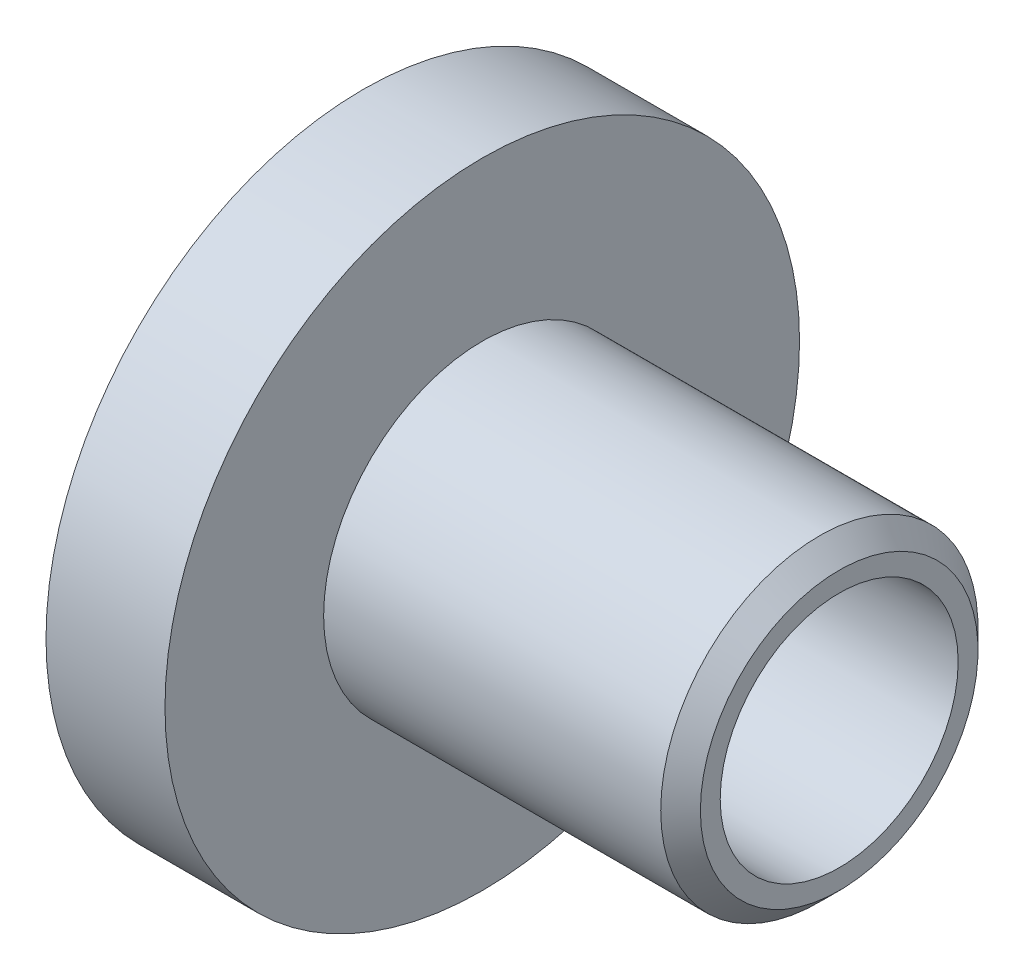
ISO-10303-21;
HEADER;
FILE_DESCRIPTION(('STEP AP214'),'2;1');
FILE_NAME('part.step','',(''),(''),'','','');
FILE_SCHEMA(('AUTOMOTIVE_DESIGN { 1 0 10303 214 1 1 1 1 }'));
ENDSEC;
DATA;
#1=APPLICATION_CONTEXT('core data for automotive mechanical design processes');
#2=APPLICATION_PROTOCOL_DEFINITION('international standard','automotive_design',2000,#1);
#3=PRODUCT_CONTEXT('',#1,'mechanical');
#4=PRODUCT('Part','Part','',(#3));
#5=PRODUCT_RELATED_PRODUCT_CATEGORY('part','',(#4));
#6=PRODUCT_DEFINITION_FORMATION('','',#4);
#7=PRODUCT_DEFINITION_CONTEXT('part definition',#1,'design');
#8=PRODUCT_DEFINITION('design','',#6,#7);
#9=PRODUCT_DEFINITION_SHAPE('','',#8);
#10=(LENGTH_UNIT() NAMED_UNIT(*) SI_UNIT(.MILLI.,.METRE.));
#11=(NAMED_UNIT(*) PLANE_ANGLE_UNIT() SI_UNIT($,.RADIAN.));
#12=(NAMED_UNIT(*) SI_UNIT($,.STERADIAN.) SOLID_ANGLE_UNIT());
#13=UNCERTAINTY_MEASURE_WITH_UNIT(LENGTH_MEASURE(1.E-05),#10,'distance_accuracy_value','');
#14=(GEOMETRIC_REPRESENTATION_CONTEXT(3) GLOBAL_UNCERTAINTY_ASSIGNED_CONTEXT((#13)) GLOBAL_UNIT_ASSIGNED_CONTEXT((#10,
#11,#12)) REPRESENTATION_CONTEXT('',''));
#15=CARTESIAN_POINT('',(0.,0.,0.));
#16=DIRECTION('',(0.,0.,1.));
#17=DIRECTION('',(1.,0.,0.));
#18=AXIS2_PLACEMENT_3D('',#15,#16,#17);
#19=CARTESIAN_POINT('',(0.,0.,0.));
#20=DIRECTION('',(-1.,0.,0.));
#21=DIRECTION('',(0.,0.,1.));
#22=AXIS2_PLACEMENT_3D('',#19,#20,#21);
#23=CYLINDRICAL_SURFACE('',#22,6.);
#24=CARTESIAN_POINT('',(24.,0.,0.));
#25=DIRECTION('',(-1.,0.,0.));
#26=DIRECTION('',(0.,0.,1.));
#27=AXIS2_PLACEMENT_3D('',#24,#25,#26);
#28=CIRCLE('',#27,6.);
#29=CARTESIAN_POINT('',(24.,0.,6.));
#30=VERTEX_POINT('',#29);
#31=EDGE_CURVE('E26',#30,#30,#28,.T.);
#32=ORIENTED_EDGE('',*,*,#31,.F.);
#33=EDGE_LOOP('',(#32));
#34=FACE_BOUND('',#33,.T.);
#35=CARTESIAN_POINT('',(0.,0.,0.));
#36=DIRECTION('',(-1.,0.,0.));
#37=DIRECTION('',(0.,0.,1.));
#38=AXIS2_PLACEMENT_3D('',#35,#36,#37);
#39=CIRCLE('',#38,6.);
#40=CARTESIAN_POINT('',(0.,0.,6.));
#41=VERTEX_POINT('',#40);
#42=EDGE_CURVE('E41',#41,#41,#39,.T.);
#43=ORIENTED_EDGE('',*,*,#42,.T.);
#44=EDGE_LOOP('',(#43));
#45=FACE_BOUND('',#44,.T.);
#46=ADVANCED_FACE('F15',(#34,#45),#23,.F.);
#47=CARTESIAN_POINT('',(24.,8.,0.));
#48=DIRECTION('',(-1.,0.,0.));
#49=DIRECTION('',(0.,0.,1.));
#50=AXIS2_PLACEMENT_3D('',#47,#48,#49);
#51=PLANE('',#50);
#52=CARTESIAN_POINT('',(24.,0.,0.));
#53=DIRECTION('',(-1.,0.,0.));
#54=DIRECTION('',(0.,0.,1.));
#55=AXIS2_PLACEMENT_3D('',#52,#53,#54);
#56=CIRCLE('',#55,7.);
#57=CARTESIAN_POINT('',(24.,0.,7.));
#58=VERTEX_POINT('',#57);
#59=EDGE_CURVE('E10',#58,#58,#56,.F.);
#60=ORIENTED_EDGE('',*,*,#59,.T.);
#61=EDGE_LOOP('',(#60));
#62=FACE_BOUND('',#61,.T.);
#63=ORIENTED_EDGE('',*,*,#31,.T.);
#64=EDGE_LOOP('',(#63));
#65=FACE_BOUND('',#64,.T.);
#66=ADVANCED_FACE('F66',(#62,#65),#51,.F.);
#67=CARTESIAN_POINT('',(0.,0.,0.));
#68=DIRECTION('',(-1.,0.,0.));
#69=DIRECTION('',(0.,0.,1.));
#70=AXIS2_PLACEMENT_3D('',#67,#68,#69);
#71=CYLINDRICAL_SURFACE('',#70,8.);
#72=CARTESIAN_POINT('',(23.,0.,0.));
#73=DIRECTION('',(-1.,0.,0.));
#74=DIRECTION('',(0.,0.,1.));
#75=AXIS2_PLACEMENT_3D('',#72,#73,#74);
#76=CIRCLE('',#75,8.);
#77=CARTESIAN_POINT('',(23.,0.,8.));
#78=VERTEX_POINT('',#77);
#79=EDGE_CURVE('E22',#78,#78,#76,.T.);
#80=ORIENTED_EDGE('',*,*,#79,.T.);
#81=EDGE_LOOP('',(#80));
#82=FACE_BOUND('',#81,.T.);
#83=CARTESIAN_POINT('',(6.,0.,0.));
#84=DIRECTION('',(-1.,0.,0.));
#85=DIRECTION('',(0.,0.,1.));
#86=AXIS2_PLACEMENT_3D('',#83,#84,#85);
#87=CIRCLE('',#86,8.);
#88=CARTESIAN_POINT('',(6.,0.,8.));
#89=VERTEX_POINT('',#88);
#90=EDGE_CURVE('E30',#89,#89,#87,.T.);
#91=ORIENTED_EDGE('',*,*,#90,.F.);
#92=EDGE_LOOP('',(#91));
#93=FACE_BOUND('',#92,.T.);
#94=ADVANCED_FACE('F61',(#82,#93),#71,.T.);
#95=CARTESIAN_POINT('',(6.,16.,0.));
#96=DIRECTION('',(-1.,0.,0.));
#97=DIRECTION('',(0.,0.,1.));
#98=AXIS2_PLACEMENT_3D('',#95,#96,#97);
#99=PLANE('',#98);
#100=CARTESIAN_POINT('',(6.,0.,0.));
#101=DIRECTION('',(-1.,0.,0.));
#102=DIRECTION('',(0.,0.,1.));
#103=AXIS2_PLACEMENT_3D('',#100,#101,#102);
#104=CIRCLE('',#103,16.);
#105=CARTESIAN_POINT('',(6.,0.,16.));
#106=VERTEX_POINT('',#105);
#107=EDGE_CURVE('E35',#106,#106,#104,.T.);
#108=ORIENTED_EDGE('',*,*,#107,.F.);
#109=EDGE_LOOP('',(#108));
#110=FACE_BOUND('',#109,.T.);
#111=ORIENTED_EDGE('',*,*,#90,.T.);
#112=EDGE_LOOP('',(#111));
#113=FACE_BOUND('',#112,.T.);
#114=ADVANCED_FACE('F55',(#110,#113),#99,.F.);
#115=CARTESIAN_POINT('',(0.,0.,0.));
#116=DIRECTION('',(-1.,0.,0.));
#117=DIRECTION('',(0.,0.,1.));
#118=AXIS2_PLACEMENT_3D('',#115,#116,#117);
#119=CYLINDRICAL_SURFACE('',#118,16.);
#120=CARTESIAN_POINT('',(0.,0.,0.));
#121=DIRECTION('',(-1.,0.,0.));
#122=DIRECTION('',(0.,0.,1.));
#123=AXIS2_PLACEMENT_3D('',#120,#121,#122);
#124=CIRCLE('',#123,16.);
#125=CARTESIAN_POINT('',(0.,0.,16.));
#126=VERTEX_POINT('',#125);
#127=EDGE_CURVE('E38',#126,#126,#124,.T.);
#128=ORIENTED_EDGE('',*,*,#127,.F.);
#129=EDGE_LOOP('',(#128));
#130=FACE_BOUND('',#129,.T.);
#131=ORIENTED_EDGE('',*,*,#107,.T.);
#132=EDGE_LOOP('',(#131));
#133=FACE_BOUND('',#132,.T.);
#134=ADVANCED_FACE('F49',(#130,#133),#119,.T.);
#135=CARTESIAN_POINT('',(0.,6.,0.));
#136=DIRECTION('',(1.,0.,0.));
#137=DIRECTION('',(0.,0.,-1.));
#138=AXIS2_PLACEMENT_3D('',#135,#136,#137);
#139=PLANE('',#138);
#140=ORIENTED_EDGE('',*,*,#42,.F.);
#141=EDGE_LOOP('',(#140));
#142=FACE_BOUND('',#141,.T.);
#143=ORIENTED_EDGE('',*,*,#127,.T.);
#144=EDGE_LOOP('',(#143));
#145=FACE_BOUND('',#144,.T.);
#146=ADVANCED_FACE('F46',(#142,#145),#139,.F.);
#147=CARTESIAN_POINT('',(23.,0.,0.));
#148=DIRECTION('',(-1.,0.,0.));
#149=DIRECTION('',(0.,0.,1.));
#150=AXIS2_PLACEMENT_3D('',#147,#148,#149);
#151=CONICAL_SURFACE('',#150,8.,0.78539816339745);
#152=ORIENTED_EDGE('',*,*,#59,.F.);
#153=EDGE_LOOP('',(#152));
#154=FACE_BOUND('',#153,.T.);
#155=ORIENTED_EDGE('',*,*,#79,.F.);
#156=EDGE_LOOP('',(#155));
#157=FACE_BOUND('',#156,.T.);
#158=ADVANCED_FACE('F17',(#154,#157),#151,.T.);
#159=CLOSED_SHELL('',(#46,#66,#94,#114,#134,#146,#158));
#160=MANIFOLD_SOLID_BREP('B1',#159);
#161=ADVANCED_BREP_SHAPE_REPRESENTATION('',(#18,#160),#14);
#162=SHAPE_DEFINITION_REPRESENTATION(#9,#161);
ENDSEC;
END-ISO-10303-21;
